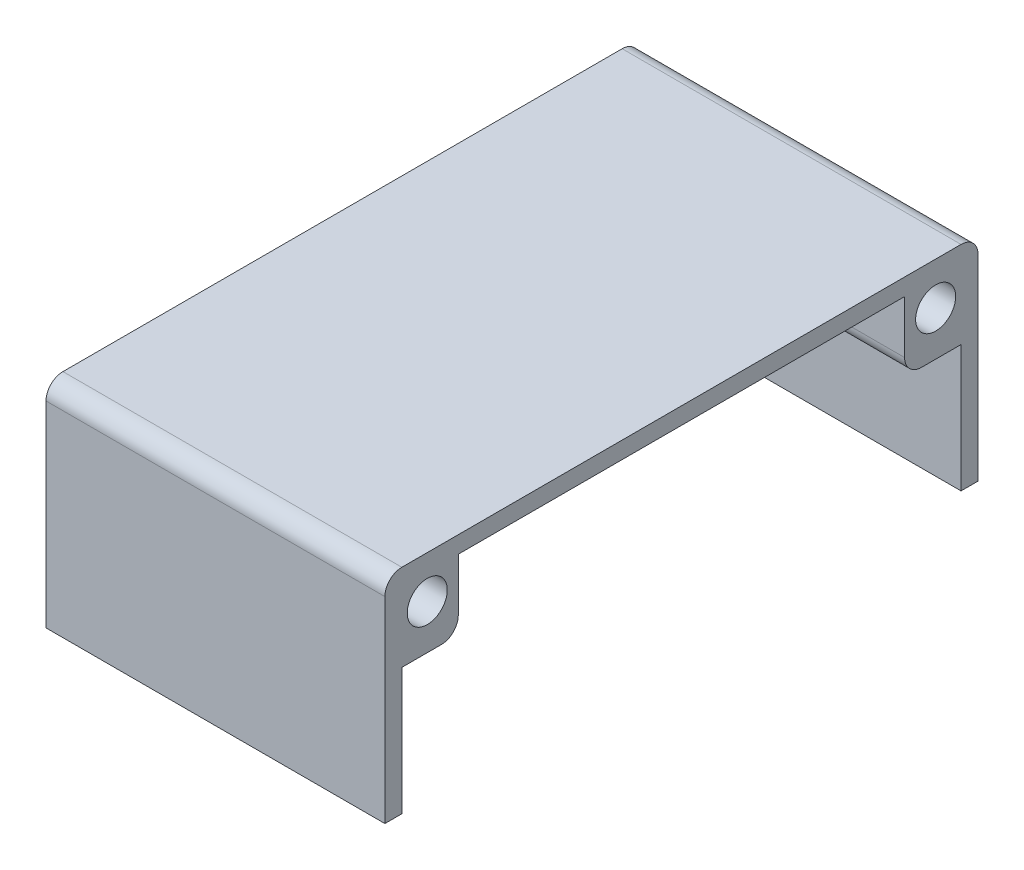
ISO-10303-21;
HEADER;
FILE_DESCRIPTION(('STEP AP214'),'2;1');
FILE_NAME('part.step','',(''),(''),'','','');
FILE_SCHEMA(('AUTOMOTIVE_DESIGN { 1 0 10303 214 1 1 1 1 }'));
ENDSEC;
DATA;
#1=APPLICATION_CONTEXT('core data for automotive mechanical design processes');
#2=APPLICATION_PROTOCOL_DEFINITION('international standard','automotive_design',2000,#1);
#3=PRODUCT_CONTEXT('',#1,'mechanical');
#4=PRODUCT('Part','Part','',(#3));
#5=PRODUCT_RELATED_PRODUCT_CATEGORY('part','',(#4));
#6=PRODUCT_DEFINITION_FORMATION('','',#4);
#7=PRODUCT_DEFINITION_CONTEXT('part definition',#1,'design');
#8=PRODUCT_DEFINITION('design','',#6,#7);
#9=PRODUCT_DEFINITION_SHAPE('','',#8);
#10=(LENGTH_UNIT() NAMED_UNIT(*) SI_UNIT(.MILLI.,.METRE.));
#11=(NAMED_UNIT(*) PLANE_ANGLE_UNIT() SI_UNIT($,.RADIAN.));
#12=(NAMED_UNIT(*) SI_UNIT($,.STERADIAN.) SOLID_ANGLE_UNIT());
#13=UNCERTAINTY_MEASURE_WITH_UNIT(LENGTH_MEASURE(1.E-05),#10,'distance_accuracy_value','');
#14=(GEOMETRIC_REPRESENTATION_CONTEXT(3) GLOBAL_UNCERTAINTY_ASSIGNED_CONTEXT((#13)) GLOBAL_UNIT_ASSIGNED_CONTEXT((#10,
#11,#12)) REPRESENTATION_CONTEXT('',''));
#15=CARTESIAN_POINT('',(0.,0.,0.));
#16=DIRECTION('',(0.,0.,1.));
#17=DIRECTION('',(1.,0.,0.));
#18=AXIS2_PLACEMENT_3D('',#15,#16,#17);
#19=CARTESIAN_POINT('',(50.8,-16.002,44.4525));
#20=DIRECTION('',(0.,1.,0.));
#21=DIRECTION('',(0.,0.,1.));
#22=AXIS2_PLACEMENT_3D('',#19,#20,#21);
#23=PLANE('',#22);
#24=DIRECTION('',(0.,0.,-1.));
#25=VECTOR('',#24,1.);
#26=CARTESIAN_POINT('',(50.8,-16.002,44.4525));
#27=LINE('',#26,#25);
#28=CARTESIAN_POINT('',(50.8,-16.002,-41.9125));
#29=VERTEX_POINT('',#28);
#30=CARTESIAN_POINT('',(50.8,-16.002,-44.4525));
#31=VERTEX_POINT('',#30);
#32=EDGE_CURVE('E167',#29,#31,#27,.T.);
#33=ORIENTED_EDGE('',*,*,#32,.F.);
#34=DIRECTION('',(-1.,0.,0.));
#35=VECTOR('',#34,1.);
#36=CARTESIAN_POINT('',(90.,-16.002,-41.9125));
#37=LINE('',#36,#35);
#38=CARTESIAN_POINT('',(0.,-16.002,-41.9125));
#39=VERTEX_POINT('',#38);
#40=EDGE_CURVE('E152',#29,#39,#37,.T.);
#41=ORIENTED_EDGE('',*,*,#40,.T.);
#42=DIRECTION('',(0.,0.,-1.));
#43=VECTOR('',#42,1.);
#44=CARTESIAN_POINT('',(0.,-16.002,44.4525));
#45=LINE('',#44,#43);
#46=CARTESIAN_POINT('',(0.,-16.002,-44.4525));
#47=VERTEX_POINT('',#46);
#48=EDGE_CURVE('E165',#39,#47,#45,.T.);
#49=ORIENTED_EDGE('',*,*,#48,.T.);
#50=DIRECTION('',(-1.,0.,0.));
#51=VECTOR('',#50,1.);
#52=CARTESIAN_POINT('',(50.8,-16.002,-44.4525));
#53=LINE('',#52,#51);
#54=EDGE_CURVE('E186',#31,#47,#53,.T.);
#55=ORIENTED_EDGE('',*,*,#54,.F.);
#56=EDGE_LOOP('',(#33,#41,#49,#55));
#57=FACE_BOUND('',#56,.T.);
#58=ADVANCED_FACE('F36',(#57),#23,.F.);
#59=CARTESIAN_POINT('',(50.8,-16.002,-44.4525));
#60=DIRECTION('',(0.,0.,1.));
#61=DIRECTION('',(1.,0.,0.));
#62=AXIS2_PLACEMENT_3D('',#59,#60,#61);
#63=PLANE('',#62);
#64=DIRECTION('',(0.,1.,0.));
#65=VECTOR('',#64,1.);
#66=CARTESIAN_POINT('',(0.,-16.002,-44.4525));
#67=LINE('',#66,#65);
#68=CARTESIAN_POINT('',(0.,13.462,-44.4525));
#69=VERTEX_POINT('',#68);
#70=EDGE_CURVE('E176',#47,#69,#67,.T.);
#71=ORIENTED_EDGE('',*,*,#70,.T.);
#72=DIRECTION('',(-1.,0.,0.));
#73=VECTOR('',#72,1.);
#74=CARTESIAN_POINT('',(50.8,13.462,-44.4525));
#75=LINE('',#74,#73);
#76=CARTESIAN_POINT('',(50.8,13.462,-44.4525));
#77=VERTEX_POINT('',#76);
#78=EDGE_CURVE('E197',#69,#77,#75,.F.);
#79=ORIENTED_EDGE('',*,*,#78,.T.);
#80=DIRECTION('',(0.,1.,0.));
#81=VECTOR('',#80,1.);
#82=CARTESIAN_POINT('',(50.8,-16.002,-44.4525));
#83=LINE('',#82,#81);
#84=EDGE_CURVE('E181',#31,#77,#83,.T.);
#85=ORIENTED_EDGE('',*,*,#84,.F.);
#86=ORIENTED_EDGE('',*,*,#54,.T.);
#87=EDGE_LOOP('',(#71,#79,#85,#86));
#88=FACE_BOUND('',#87,.T.);
#89=ADVANCED_FACE('F336',(#88),#63,.F.);
#90=CARTESIAN_POINT('',(50.8,16.002,44.4525));
#91=DIRECTION('',(0.,-1.,0.));
#92=DIRECTION('',(0.,0.,-1.));
#93=AXIS2_PLACEMENT_3D('',#90,#91,#92);
#94=PLANE('',#93);
#95=DIRECTION('',(0.,0.,1.));
#96=VECTOR('',#95,1.);
#97=CARTESIAN_POINT('',(0.,16.002,44.4525));
#98=LINE('',#97,#96);
#99=CARTESIAN_POINT('',(0.,16.002,-41.9125));
#100=VERTEX_POINT('',#99);
#101=CARTESIAN_POINT('',(0.,16.002,41.9125));
#102=VERTEX_POINT('',#101);
#103=EDGE_CURVE('E182',#100,#102,#98,.T.);
#104=ORIENTED_EDGE('',*,*,#103,.T.);
#105=DIRECTION('',(-1.,0.,0.));
#106=VECTOR('',#105,1.);
#107=CARTESIAN_POINT('',(50.8,16.002,41.9125));
#108=LINE('',#107,#106);
#109=CARTESIAN_POINT('',(50.8,16.002,41.9125));
#110=VERTEX_POINT('',#109);
#111=EDGE_CURVE('E206',#102,#110,#108,.F.);
#112=ORIENTED_EDGE('',*,*,#111,.T.);
#113=DIRECTION('',(0.,0.,1.));
#114=VECTOR('',#113,1.);
#115=CARTESIAN_POINT('',(50.8,16.002,44.4525));
#116=LINE('',#115,#114);
#117=CARTESIAN_POINT('',(50.8,16.002,-41.9125));
#118=VERTEX_POINT('',#117);
#119=EDGE_CURVE('E277',#118,#110,#116,.T.);
#120=ORIENTED_EDGE('',*,*,#119,.F.);
#121=DIRECTION('',(-1.,0.,0.));
#122=VECTOR('',#121,1.);
#123=CARTESIAN_POINT('',(50.8,16.002,-41.9125));
#124=LINE('',#123,#122);
#125=EDGE_CURVE('E192',#118,#100,#124,.T.);
#126=ORIENTED_EDGE('',*,*,#125,.T.);
#127=EDGE_LOOP('',(#104,#112,#120,#126));
#128=FACE_BOUND('',#127,.T.);
#129=ADVANCED_FACE('F288',(#128),#94,.F.);
#130=CARTESIAN_POINT('',(50.8,-16.002,44.4525));
#131=DIRECTION('',(0.,0.,-1.));
#132=DIRECTION('',(-1.,0.,0.));
#133=AXIS2_PLACEMENT_3D('',#130,#131,#132);
#134=PLANE('',#133);
#135=DIRECTION('',(0.,-1.,0.));
#136=VECTOR('',#135,1.);
#137=CARTESIAN_POINT('',(50.8,-16.002,44.4525));
#138=LINE('',#137,#136);
#139=CARTESIAN_POINT('',(50.8,13.462,44.4525));
#140=VERTEX_POINT('',#139);
#141=CARTESIAN_POINT('',(50.8,-16.002,44.4525));
#142=VERTEX_POINT('',#141);
#143=EDGE_CURVE('E280',#140,#142,#138,.T.);
#144=ORIENTED_EDGE('',*,*,#143,.F.);
#145=DIRECTION('',(-1.,0.,0.));
#146=VECTOR('',#145,1.);
#147=CARTESIAN_POINT('',(50.8,13.462,44.4525));
#148=LINE('',#147,#146);
#149=CARTESIAN_POINT('',(0.,13.462,44.4525));
#150=VERTEX_POINT('',#149);
#151=EDGE_CURVE('E201',#140,#150,#148,.T.);
#152=ORIENTED_EDGE('',*,*,#151,.T.);
#153=DIRECTION('',(0.,-1.,0.));
#154=VECTOR('',#153,1.);
#155=CARTESIAN_POINT('',(0.,-16.002,44.4525));
#156=LINE('',#155,#154);
#157=CARTESIAN_POINT('',(0.,-16.002,44.4525));
#158=VERTEX_POINT('',#157);
#159=EDGE_CURVE('E178',#150,#158,#156,.T.);
#160=ORIENTED_EDGE('',*,*,#159,.T.);
#161=DIRECTION('',(-1.,0.,0.));
#162=VECTOR('',#161,1.);
#163=CARTESIAN_POINT('',(50.8,-16.002,44.4525));
#164=LINE('',#163,#162);
#165=EDGE_CURVE('E188',#142,#158,#164,.T.);
#166=ORIENTED_EDGE('',*,*,#165,.F.);
#167=EDGE_LOOP('',(#144,#152,#160,#166));
#168=FACE_BOUND('',#167,.T.);
#169=ADVANCED_FACE('F301',(#168),#134,.F.);
#170=CARTESIAN_POINT('',(0.,-16.002,41.9125));
#171=VERTEX_POINT('',#170);
#172=EDGE_CURVE('E177',#158,#171,#45,.T.);
#173=ORIENTED_EDGE('',*,*,#172,.T.);
#174=DIRECTION('',(-1.,0.,0.));
#175=VECTOR('',#174,1.);
#176=CARTESIAN_POINT('',(90.,-16.002,41.9125));
#177=LINE('',#176,#175);
#178=CARTESIAN_POINT('',(50.8,-16.002,41.9125));
#179=VERTEX_POINT('',#178);
#180=EDGE_CURVE('E168',#179,#171,#177,.T.);
#181=ORIENTED_EDGE('',*,*,#180,.F.);
#182=EDGE_CURVE('E189',#142,#179,#27,.T.);
#183=ORIENTED_EDGE('',*,*,#182,.F.);
#184=ORIENTED_EDGE('',*,*,#165,.T.);
#185=EDGE_LOOP('',(#173,#181,#183,#184));
#186=FACE_BOUND('',#185,.T.);
#187=ADVANCED_FACE('F307',(#186),#23,.F.);
#188=CARTESIAN_POINT('',(50.8,0.,0.));
#189=DIRECTION('',(-1.,0.,0.));
#190=DIRECTION('',(0.,0.,1.));
#191=AXIS2_PLACEMENT_3D('',#188,#189,#190);
#192=PLANE('',#191);
#193=DIRECTION('',(0.,0.,1.));
#194=VECTOR('',#193,1.);
#195=CARTESIAN_POINT('',(50.8,3.002,33.4525));
#196=LINE('',#195,#194);
#197=CARTESIAN_POINT('',(50.8,3.002,35.9925));
#198=VERTEX_POINT('',#197);
#199=CARTESIAN_POINT('',(50.8,3.002,41.9125));
#200=VERTEX_POINT('',#199);
#201=EDGE_CURVE('E253',#198,#200,#196,.T.);
#202=ORIENTED_EDGE('',*,*,#201,.F.);
#203=CARTESIAN_POINT('',(50.8,5.542,35.9925));
#204=DIRECTION('',(-1.,0.,0.));
#205=DIRECTION('',(0.,0.,1.));
#206=AXIS2_PLACEMENT_3D('',#203,#204,#205);
#207=CIRCLE('',#206,2.54);
#208=CARTESIAN_POINT('',(50.8,5.542,33.4525));
#209=VERTEX_POINT('',#208);
#210=EDGE_CURVE('E220',#198,#209,#207,.F.);
#211=ORIENTED_EDGE('',*,*,#210,.T.);
#212=DIRECTION('',(0.,-1.,0.));
#213=VECTOR('',#212,1.);
#214=CARTESIAN_POINT('',(50.8,13.462,33.4525));
#215=LINE('',#214,#213);
#216=CARTESIAN_POINT('',(50.8,13.462,33.4525));
#217=VERTEX_POINT('',#216);
#218=EDGE_CURVE('E250',#217,#209,#215,.T.);
#219=ORIENTED_EDGE('',*,*,#218,.F.);
#220=DIRECTION('',(0.,0.,-1.));
#221=VECTOR('',#220,1.);
#222=CARTESIAN_POINT('',(50.8,13.462,0.));
#223=LINE('',#222,#221);
#224=CARTESIAN_POINT('',(50.8,13.462,-33.4525));
#225=VERTEX_POINT('',#224);
#226=EDGE_CURVE('E270',#217,#225,#223,.T.);
#227=ORIENTED_EDGE('',*,*,#226,.T.);
#228=DIRECTION('',(0.,1.,0.));
#229=VECTOR('',#228,1.);
#230=CARTESIAN_POINT('',(50.8,13.462,-33.4525));
#231=LINE('',#230,#229);
#232=CARTESIAN_POINT('',(50.8,5.542,-33.4525));
#233=VERTEX_POINT('',#232);
#234=EDGE_CURVE('E236',#233,#225,#231,.T.);
#235=ORIENTED_EDGE('',*,*,#234,.F.);
#236=CARTESIAN_POINT('',(50.8,5.542,-35.9925));
#237=DIRECTION('',(-1.,0.,0.));
#238=DIRECTION('',(0.,0.,1.));
#239=AXIS2_PLACEMENT_3D('',#236,#237,#238);
#240=CIRCLE('',#239,2.54);
#241=CARTESIAN_POINT('',(50.8,3.002,-35.9925));
#242=VERTEX_POINT('',#241);
#243=EDGE_CURVE('E56',#233,#242,#240,.F.);
#244=ORIENTED_EDGE('',*,*,#243,.T.);
#245=DIRECTION('',(0.,0.,1.));
#246=VECTOR('',#245,1.);
#247=CARTESIAN_POINT('',(50.8,3.002,-41.9125));
#248=LINE('',#247,#246);
#249=CARTESIAN_POINT('',(50.8,3.002,-41.9125));
#250=VERTEX_POINT('',#249);
#251=EDGE_CURVE('E226',#250,#242,#248,.T.);
#252=ORIENTED_EDGE('',*,*,#251,.F.);
#253=DIRECTION('',(0.,-1.,0.));
#254=VECTOR('',#253,1.);
#255=CARTESIAN_POINT('',(50.8,0.,-41.9125));
#256=LINE('',#255,#254);
#257=EDGE_CURVE('E273',#250,#29,#256,.T.);
#258=ORIENTED_EDGE('',*,*,#257,.T.);
#259=ORIENTED_EDGE('',*,*,#32,.T.);
#260=ORIENTED_EDGE('',*,*,#84,.T.);
#261=CARTESIAN_POINT('',(50.8,13.462,-41.9125));
#262=DIRECTION('',(-1.,0.,0.));
#263=DIRECTION('',(0.,0.,1.));
#264=AXIS2_PLACEMENT_3D('',#261,#262,#263);
#265=CIRCLE('',#264,2.54);
#266=EDGE_CURVE('E199',#77,#118,#265,.F.);
#267=ORIENTED_EDGE('',*,*,#266,.T.);
#268=ORIENTED_EDGE('',*,*,#119,.T.);
#269=CARTESIAN_POINT('',(50.8,13.462,41.9125));
#270=DIRECTION('',(-1.,0.,0.));
#271=DIRECTION('',(0.,0.,1.));
#272=AXIS2_PLACEMENT_3D('',#269,#270,#271);
#273=CIRCLE('',#272,2.54);
#274=EDGE_CURVE('E208',#110,#140,#273,.F.);
#275=ORIENTED_EDGE('',*,*,#274,.T.);
#276=ORIENTED_EDGE('',*,*,#143,.T.);
#277=ORIENTED_EDGE('',*,*,#182,.T.);
#278=DIRECTION('',(0.,1.,0.));
#279=VECTOR('',#278,1.);
#280=CARTESIAN_POINT('',(50.8,0.,41.9125));
#281=LINE('',#280,#279);
#282=EDGE_CURVE('E266',#179,#200,#281,.T.);
#283=ORIENTED_EDGE('',*,*,#282,.T.);
#284=EDGE_LOOP('',(#202,#211,#219,#227,#235,#244,#252,#258,#259,#260,#267,#268,#275,#276,#277,#283));
#285=FACE_BOUND('',#284,.T.);
#286=CARTESIAN_POINT('',(50.8,9.652,38.1025));
#287=DIRECTION('',(-1.,0.,0.));
#288=DIRECTION('',(0.,0.,1.));
#289=AXIS2_PLACEMENT_3D('',#286,#287,#288);
#290=CIRCLE('',#289,3.);
#291=CARTESIAN_POINT('',(50.8,9.652,41.1025));
#292=VERTEX_POINT('',#291);
#293=EDGE_CURVE('E244',#292,#292,#290,.T.);
#294=ORIENTED_EDGE('',*,*,#293,.T.);
#295=EDGE_LOOP('',(#294));
#296=FACE_BOUND('',#295,.T.);
#297=CARTESIAN_POINT('',(50.8,9.652,-38.1025));
#298=DIRECTION('',(-1.,0.,0.));
#299=DIRECTION('',(0.,0.,1.));
#300=AXIS2_PLACEMENT_3D('',#297,#298,#299);
#301=CIRCLE('',#300,3.);
#302=CARTESIAN_POINT('',(50.8,9.652,-35.1025));
#303=VERTEX_POINT('',#302);
#304=EDGE_CURVE('E229',#303,#303,#301,.T.);
#305=ORIENTED_EDGE('',*,*,#304,.T.);
#306=EDGE_LOOP('',(#305));
#307=FACE_BOUND('',#306,.T.);
#308=ADVANCED_FACE('F297',(#285,#296,#307),#192,.F.);
#309=CARTESIAN_POINT('',(0.,0.,0.));
#310=DIRECTION('',(-1.,0.,0.));
#311=DIRECTION('',(0.,0.,1.));
#312=AXIS2_PLACEMENT_3D('',#309,#310,#311);
#313=PLANE('',#312);
#314=DIRECTION('',(0.,-1.,0.));
#315=VECTOR('',#314,1.);
#316=CARTESIAN_POINT('',(0.,13.462,33.4525));
#317=LINE('',#316,#315);
#318=CARTESIAN_POINT('',(0.,13.462,33.4525));
#319=VERTEX_POINT('',#318);
#320=CARTESIAN_POINT('',(0.,5.542,33.4525));
#321=VERTEX_POINT('',#320);
#322=EDGE_CURVE('E247',#319,#321,#317,.T.);
#323=ORIENTED_EDGE('',*,*,#322,.T.);
#324=CARTESIAN_POINT('',(0.,5.542,35.9925));
#325=DIRECTION('',(-1.,0.,0.));
#326=DIRECTION('',(0.,0.,1.));
#327=AXIS2_PLACEMENT_3D('',#324,#325,#326);
#328=CIRCLE('',#327,2.54);
#329=CARTESIAN_POINT('',(0.,3.002,35.9925));
#330=VERTEX_POINT('',#329);
#331=EDGE_CURVE('E215',#321,#330,#328,.T.);
#332=ORIENTED_EDGE('',*,*,#331,.T.);
#333=DIRECTION('',(0.,0.,1.));
#334=VECTOR('',#333,1.);
#335=CARTESIAN_POINT('',(0.,3.002,33.4525));
#336=LINE('',#335,#334);
#337=CARTESIAN_POINT('',(0.,3.002,41.9125));
#338=VERTEX_POINT('',#337);
#339=EDGE_CURVE('E254',#330,#338,#336,.T.);
#340=ORIENTED_EDGE('',*,*,#339,.T.);
#341=DIRECTION('',(0.,1.,0.));
#342=VECTOR('',#341,1.);
#343=CARTESIAN_POINT('',(0.,-16.002,41.9125));
#344=LINE('',#343,#342);
#345=EDGE_CURVE('E160',#171,#338,#344,.T.);
#346=ORIENTED_EDGE('',*,*,#345,.F.);
#347=ORIENTED_EDGE('',*,*,#172,.F.);
#348=ORIENTED_EDGE('',*,*,#159,.F.);
#349=CARTESIAN_POINT('',(0.,13.462,41.9125));
#350=DIRECTION('',(-1.,0.,0.));
#351=DIRECTION('',(0.,0.,1.));
#352=AXIS2_PLACEMENT_3D('',#349,#350,#351);
#353=CIRCLE('',#352,2.54);
#354=EDGE_CURVE('E204',#150,#102,#353,.T.);
#355=ORIENTED_EDGE('',*,*,#354,.T.);
#356=ORIENTED_EDGE('',*,*,#103,.F.);
#357=CARTESIAN_POINT('',(0.,13.462,-41.9125));
#358=DIRECTION('',(-1.,0.,0.));
#359=DIRECTION('',(0.,0.,1.));
#360=AXIS2_PLACEMENT_3D('',#357,#358,#359);
#361=CIRCLE('',#360,2.54);
#362=EDGE_CURVE('E195',#100,#69,#361,.T.);
#363=ORIENTED_EDGE('',*,*,#362,.T.);
#364=ORIENTED_EDGE('',*,*,#70,.F.);
#365=ORIENTED_EDGE('',*,*,#48,.F.);
#366=DIRECTION('',(0.,-1.,0.));
#367=VECTOR('',#366,1.);
#368=CARTESIAN_POINT('',(0.,-16.002,-41.9125));
#369=LINE('',#368,#367);
#370=CARTESIAN_POINT('',(0.,3.002,-41.9125));
#371=VERTEX_POINT('',#370);
#372=EDGE_CURVE('E149',#371,#39,#369,.T.);
#373=ORIENTED_EDGE('',*,*,#372,.F.);
#374=DIRECTION('',(0.,0.,1.));
#375=VECTOR('',#374,1.);
#376=CARTESIAN_POINT('',(0.,3.002,-41.9125));
#377=LINE('',#376,#375);
#378=CARTESIAN_POINT('',(0.,3.002,-35.9925));
#379=VERTEX_POINT('',#378);
#380=EDGE_CURVE('E225',#371,#379,#377,.T.);
#381=ORIENTED_EDGE('',*,*,#380,.T.);
#382=CARTESIAN_POINT('',(0.,5.542,-35.9925));
#383=DIRECTION('',(-1.,0.,0.));
#384=DIRECTION('',(0.,0.,1.));
#385=AXIS2_PLACEMENT_3D('',#382,#383,#384);
#386=CIRCLE('',#385,2.54);
#387=CARTESIAN_POINT('',(0.,5.542,-33.4525));
#388=VERTEX_POINT('',#387);
#389=EDGE_CURVE('E213',#379,#388,#386,.T.);
#390=ORIENTED_EDGE('',*,*,#389,.T.);
#391=DIRECTION('',(0.,1.,0.));
#392=VECTOR('',#391,1.);
#393=CARTESIAN_POINT('',(0.,13.462,-33.4525));
#394=LINE('',#393,#392);
#395=CARTESIAN_POINT('',(0.,13.462,-33.4525));
#396=VERTEX_POINT('',#395);
#397=EDGE_CURVE('E228',#388,#396,#394,.T.);
#398=ORIENTED_EDGE('',*,*,#397,.T.);
#399=DIRECTION('',(0.,0.,-1.));
#400=VECTOR('',#399,1.);
#401=CARTESIAN_POINT('',(0.,13.462,-41.9125));
#402=LINE('',#401,#400);
#403=EDGE_CURVE('E169',#319,#396,#402,.T.);
#404=ORIENTED_EDGE('',*,*,#403,.F.);
#405=EDGE_LOOP('',(#323,#332,#340,#346,#347,#348,#355,#356,#363,#364,#365,#373,#381,#390,#398,#404));
#406=FACE_BOUND('',#405,.T.);
#407=CARTESIAN_POINT('',(0.,9.652,38.1025));
#408=DIRECTION('',(-1.,0.,0.));
#409=DIRECTION('',(0.,0.,1.));
#410=AXIS2_PLACEMENT_3D('',#407,#408,#409);
#411=CIRCLE('',#410,3.);
#412=CARTESIAN_POINT('',(0.,9.652,41.1025));
#413=VERTEX_POINT('',#412);
#414=EDGE_CURVE('E242',#413,#413,#411,.T.);
#415=ORIENTED_EDGE('',*,*,#414,.F.);
#416=EDGE_LOOP('',(#415));
#417=FACE_BOUND('',#416,.T.);
#418=CARTESIAN_POINT('',(0.,9.652,-38.1025));
#419=DIRECTION('',(-1.,0.,0.));
#420=DIRECTION('',(0.,0.,1.));
#421=AXIS2_PLACEMENT_3D('',#418,#419,#420);
#422=CIRCLE('',#421,3.);
#423=CARTESIAN_POINT('',(0.,9.652,-35.1025));
#424=VERTEX_POINT('',#423);
#425=EDGE_CURVE('E233',#424,#424,#422,.T.);
#426=ORIENTED_EDGE('',*,*,#425,.F.);
#427=EDGE_LOOP('',(#426));
#428=FACE_BOUND('',#427,.T.);
#429=ADVANCED_FACE('F173',(#406,#417,#428),#313,.T.);
#430=CARTESIAN_POINT('',(50.8,13.462,-41.9125));
#431=DIRECTION('',(-1.,0.,0.));
#432=DIRECTION('',(0.,0.,1.));
#433=AXIS2_PLACEMENT_3D('',#430,#431,#432);
#434=CYLINDRICAL_SURFACE('',#433,2.54);
#435=ORIENTED_EDGE('',*,*,#266,.F.);
#436=ORIENTED_EDGE('',*,*,#78,.F.);
#437=ORIENTED_EDGE('',*,*,#362,.F.);
#438=ORIENTED_EDGE('',*,*,#125,.F.);
#439=EDGE_LOOP('',(#435,#436,#437,#438));
#440=FACE_BOUND('',#439,.T.);
#441=ADVANCED_FACE('F356',(#440),#434,.T.);
#442=CARTESIAN_POINT('',(50.8,13.462,41.9125));
#443=DIRECTION('',(-1.,0.,0.));
#444=DIRECTION('',(0.,0.,1.));
#445=AXIS2_PLACEMENT_3D('',#442,#443,#444);
#446=CYLINDRICAL_SURFACE('',#445,2.54);
#447=ORIENTED_EDGE('',*,*,#274,.F.);
#448=ORIENTED_EDGE('',*,*,#111,.F.);
#449=ORIENTED_EDGE('',*,*,#354,.F.);
#450=ORIENTED_EDGE('',*,*,#151,.F.);
#451=EDGE_LOOP('',(#447,#448,#449,#450));
#452=FACE_BOUND('',#451,.T.);
#453=ADVANCED_FACE('F293',(#452),#446,.T.);
#454=CARTESIAN_POINT('',(90.,-16.002,-41.9125));
#455=DIRECTION('',(0.,0.,-1.));
#456=DIRECTION('',(-1.,0.,0.));
#457=AXIS2_PLACEMENT_3D('',#454,#455,#456);
#458=PLANE('',#457);
#459=ORIENTED_EDGE('',*,*,#257,.F.);
#460=DIRECTION('',(-1.,0.,0.));
#461=VECTOR('',#460,1.);
#462=CARTESIAN_POINT('',(50.8,3.002,-41.9125));
#463=LINE('',#462,#461);
#464=EDGE_CURVE('E155',#250,#371,#463,.T.);
#465=ORIENTED_EDGE('',*,*,#464,.T.);
#466=ORIENTED_EDGE('',*,*,#372,.T.);
#467=ORIENTED_EDGE('',*,*,#40,.F.);
#468=EDGE_LOOP('',(#459,#465,#466,#467));
#469=FACE_BOUND('',#468,.T.);
#470=ADVANCED_FACE('F151',(#469),#458,.F.);
#471=CARTESIAN_POINT('',(90.,13.462,-41.9125));
#472=DIRECTION('',(0.,1.,0.));
#473=DIRECTION('',(0.,0.,1.));
#474=AXIS2_PLACEMENT_3D('',#471,#472,#473);
#475=PLANE('',#474);
#476=ORIENTED_EDGE('',*,*,#403,.T.);
#477=DIRECTION('',(-1.,0.,0.));
#478=VECTOR('',#477,1.);
#479=CARTESIAN_POINT('',(50.8,13.462,-33.4525));
#480=LINE('',#479,#478);
#481=EDGE_CURVE('E239',#225,#396,#480,.T.);
#482=ORIENTED_EDGE('',*,*,#481,.F.);
#483=ORIENTED_EDGE('',*,*,#226,.F.);
#484=DIRECTION('',(-1.,0.,0.));
#485=VECTOR('',#484,1.);
#486=CARTESIAN_POINT('',(50.8,13.462,33.4525));
#487=LINE('',#486,#485);
#488=EDGE_CURVE('E161',#217,#319,#487,.T.);
#489=ORIENTED_EDGE('',*,*,#488,.T.);
#490=EDGE_LOOP('',(#476,#482,#483,#489));
#491=FACE_BOUND('',#490,.T.);
#492=ADVANCED_FACE('F327',(#491),#475,.F.);
#493=CARTESIAN_POINT('',(90.,-16.002,41.9125));
#494=DIRECTION('',(0.,0.,1.));
#495=DIRECTION('',(0.,-1.,0.));
#496=AXIS2_PLACEMENT_3D('',#493,#494,#495);
#497=PLANE('',#496);
#498=ORIENTED_EDGE('',*,*,#345,.T.);
#499=DIRECTION('',(-1.,0.,0.));
#500=VECTOR('',#499,1.);
#501=CARTESIAN_POINT('',(50.8,3.002,41.9125));
#502=LINE('',#501,#500);
#503=EDGE_CURVE('E256',#200,#338,#502,.T.);
#504=ORIENTED_EDGE('',*,*,#503,.F.);
#505=ORIENTED_EDGE('',*,*,#282,.F.);
#506=ORIENTED_EDGE('',*,*,#180,.T.);
#507=EDGE_LOOP('',(#498,#504,#505,#506));
#508=FACE_BOUND('',#507,.T.);
#509=ADVANCED_FACE('F311',(#508),#497,.F.);
#510=CARTESIAN_POINT('',(50.8,13.462,33.4525));
#511=DIRECTION('',(0.,0.,-1.));
#512=DIRECTION('',(-1.,0.,0.));
#513=AXIS2_PLACEMENT_3D('',#510,#511,#512);
#514=PLANE('',#513);
#515=ORIENTED_EDGE('',*,*,#218,.T.);
#516=DIRECTION('',(-1.,0.,0.));
#517=VECTOR('',#516,1.);
#518=CARTESIAN_POINT('',(50.8,5.542,33.4525));
#519=LINE('',#518,#517);
#520=EDGE_CURVE('E210',#209,#321,#519,.T.);
#521=ORIENTED_EDGE('',*,*,#520,.T.);
#522=ORIENTED_EDGE('',*,*,#322,.F.);
#523=ORIENTED_EDGE('',*,*,#488,.F.);
#524=EDGE_LOOP('',(#515,#521,#522,#523));
#525=FACE_BOUND('',#524,.T.);
#526=ADVANCED_FACE('F323',(#525),#514,.T.);
#527=CARTESIAN_POINT('',(50.8,3.002,33.4525));
#528=DIRECTION('',(0.,-1.,0.));
#529=DIRECTION('',(0.,0.,-1.));
#530=AXIS2_PLACEMENT_3D('',#527,#528,#529);
#531=PLANE('',#530);
#532=ORIENTED_EDGE('',*,*,#339,.F.);
#533=DIRECTION('',(-1.,0.,0.));
#534=VECTOR('',#533,1.);
#535=CARTESIAN_POINT('',(50.8,3.002,35.9925));
#536=LINE('',#535,#534);
#537=EDGE_CURVE('E217',#330,#198,#536,.F.);
#538=ORIENTED_EDGE('',*,*,#537,.T.);
#539=ORIENTED_EDGE('',*,*,#201,.T.);
#540=ORIENTED_EDGE('',*,*,#503,.T.);
#541=EDGE_LOOP('',(#532,#538,#539,#540));
#542=FACE_BOUND('',#541,.T.);
#543=ADVANCED_FACE('F315',(#542),#531,.T.);
#544=CARTESIAN_POINT('',(50.8,9.652,38.1025));
#545=DIRECTION('',(-1.,0.,0.));
#546=DIRECTION('',(0.,0.,1.));
#547=AXIS2_PLACEMENT_3D('',#544,#545,#546);
#548=CYLINDRICAL_SURFACE('',#547,3.);
#549=ORIENTED_EDGE('',*,*,#293,.F.);
#550=EDGE_LOOP('',(#549));
#551=FACE_BOUND('',#550,.T.);
#552=ORIENTED_EDGE('',*,*,#414,.T.);
#553=EDGE_LOOP('',(#552));
#554=FACE_BOUND('',#553,.T.);
#555=ADVANCED_FACE('F423',(#551,#554),#548,.F.);
#556=CARTESIAN_POINT('',(50.8,13.462,-33.4525));
#557=DIRECTION('',(0.,0.,1.));
#558=DIRECTION('',(1.,0.,0.));
#559=AXIS2_PLACEMENT_3D('',#556,#557,#558);
#560=PLANE('',#559);
#561=ORIENTED_EDGE('',*,*,#397,.F.);
#562=DIRECTION('',(-1.,0.,0.));
#563=VECTOR('',#562,1.);
#564=CARTESIAN_POINT('',(50.8,5.542,-33.4525));
#565=LINE('',#564,#563);
#566=EDGE_CURVE('E11',#388,#233,#565,.F.);
#567=ORIENTED_EDGE('',*,*,#566,.T.);
#568=ORIENTED_EDGE('',*,*,#234,.T.);
#569=ORIENTED_EDGE('',*,*,#481,.T.);
#570=EDGE_LOOP('',(#561,#567,#568,#569));
#571=FACE_BOUND('',#570,.T.);
#572=ADVANCED_FACE('F329',(#571),#560,.T.);
#573=CARTESIAN_POINT('',(50.8,3.002,-41.9125));
#574=DIRECTION('',(0.,-1.,0.));
#575=DIRECTION('',(0.,0.,-1.));
#576=AXIS2_PLACEMENT_3D('',#573,#574,#575);
#577=PLANE('',#576);
#578=ORIENTED_EDGE('',*,*,#251,.T.);
#579=DIRECTION('',(-1.,0.,0.));
#580=VECTOR('',#579,1.);
#581=CARTESIAN_POINT('',(50.8,3.002,-35.9925));
#582=LINE('',#581,#580);
#583=EDGE_CURVE('E44',#242,#379,#582,.T.);
#584=ORIENTED_EDGE('',*,*,#583,.T.);
#585=ORIENTED_EDGE('',*,*,#380,.F.);
#586=ORIENTED_EDGE('',*,*,#464,.F.);
#587=EDGE_LOOP('',(#578,#584,#585,#586));
#588=FACE_BOUND('',#587,.T.);
#589=ADVANCED_FACE('F224',(#588),#577,.T.);
#590=CARTESIAN_POINT('',(50.8,9.652,-38.1025));
#591=DIRECTION('',(-1.,0.,0.));
#592=DIRECTION('',(0.,0.,1.));
#593=AXIS2_PLACEMENT_3D('',#590,#591,#592);
#594=CYLINDRICAL_SURFACE('',#593,3.);
#595=ORIENTED_EDGE('',*,*,#304,.F.);
#596=EDGE_LOOP('',(#595));
#597=FACE_BOUND('',#596,.T.);
#598=ORIENTED_EDGE('',*,*,#425,.T.);
#599=EDGE_LOOP('',(#598));
#600=FACE_BOUND('',#599,.T.);
#601=ADVANCED_FACE('F334',(#597,#600),#594,.F.);
#602=CARTESIAN_POINT('',(50.8,5.542,35.9925));
#603=DIRECTION('',(-1.,0.,0.));
#604=DIRECTION('',(0.,0.,1.));
#605=AXIS2_PLACEMENT_3D('',#602,#603,#604);
#606=CYLINDRICAL_SURFACE('',#605,2.54);
#607=ORIENTED_EDGE('',*,*,#210,.F.);
#608=ORIENTED_EDGE('',*,*,#537,.F.);
#609=ORIENTED_EDGE('',*,*,#331,.F.);
#610=ORIENTED_EDGE('',*,*,#520,.F.);
#611=EDGE_LOOP('',(#607,#608,#609,#610));
#612=FACE_BOUND('',#611,.T.);
#613=ADVANCED_FACE('F318',(#612),#606,.T.);
#614=CARTESIAN_POINT('',(50.8,5.542,-35.9925));
#615=DIRECTION('',(-1.,0.,0.));
#616=DIRECTION('',(0.,0.,1.));
#617=AXIS2_PLACEMENT_3D('',#614,#615,#616);
#618=CYLINDRICAL_SURFACE('',#617,2.54);
#619=ORIENTED_EDGE('',*,*,#243,.F.);
#620=ORIENTED_EDGE('',*,*,#566,.F.);
#621=ORIENTED_EDGE('',*,*,#389,.F.);
#622=ORIENTED_EDGE('',*,*,#583,.F.);
#623=EDGE_LOOP('',(#619,#620,#621,#622));
#624=FACE_BOUND('',#623,.T.);
#625=ADVANCED_FACE('F38',(#624),#618,.T.);
#626=CLOSED_SHELL('',(#58,#89,#129,#169,#187,#308,#429,#441,#453,#470,#492,#509,#526,#543,#555,
#572,#589,#601,#613,#625));
#627=MANIFOLD_SOLID_BREP('B2',#626);
#628=ADVANCED_BREP_SHAPE_REPRESENTATION('',(#18,#627),#14);
#629=SHAPE_DEFINITION_REPRESENTATION(#9,#628);
ENDSEC;
END-ISO-10303-21;
